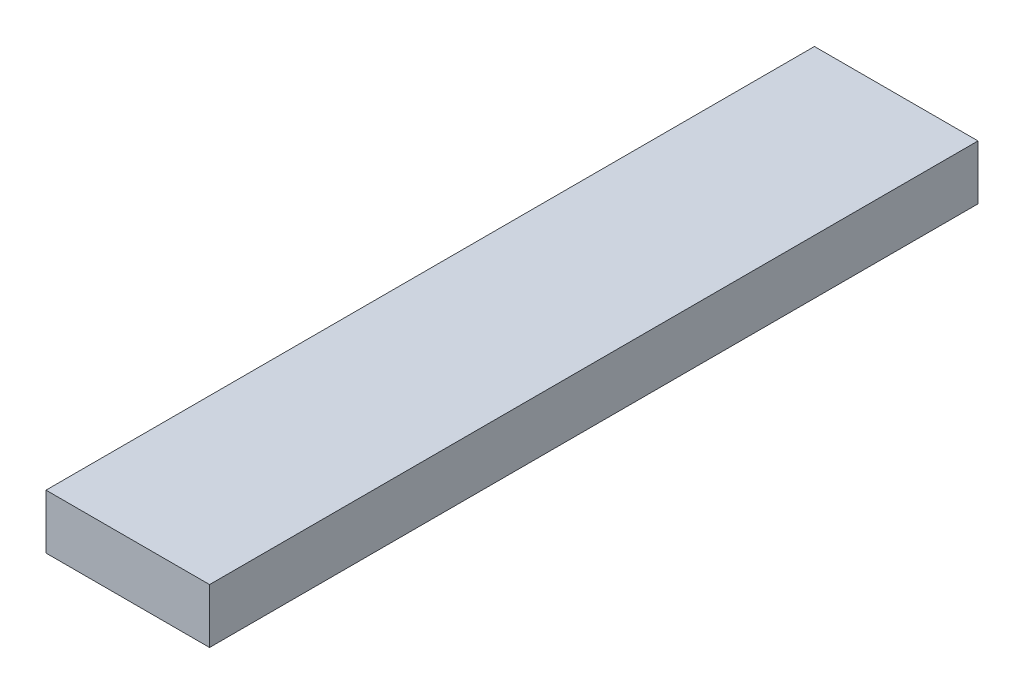
ISO-10303-21;
HEADER;
FILE_DESCRIPTION(('STEP AP214'),'2;1');
FILE_NAME('part.step','',(''),(''),'','','');
FILE_SCHEMA(('AUTOMOTIVE_DESIGN { 1 0 10303 214 1 1 1 1 }'));
ENDSEC;
DATA;
#1=APPLICATION_CONTEXT('core data for automotive mechanical design processes');
#2=APPLICATION_PROTOCOL_DEFINITION('international standard','automotive_design',2000,#1);
#3=PRODUCT_CONTEXT('',#1,'mechanical');
#4=PRODUCT('Part','Part','',(#3));
#5=PRODUCT_RELATED_PRODUCT_CATEGORY('part','',(#4));
#6=PRODUCT_DEFINITION_FORMATION('','',#4);
#7=PRODUCT_DEFINITION_CONTEXT('part definition',#1,'design');
#8=PRODUCT_DEFINITION('design','',#6,#7);
#9=PRODUCT_DEFINITION_SHAPE('','',#8);
#10=(LENGTH_UNIT() NAMED_UNIT(*) SI_UNIT(.MILLI.,.METRE.));
#11=(NAMED_UNIT(*) PLANE_ANGLE_UNIT() SI_UNIT($,.RADIAN.));
#12=(NAMED_UNIT(*) SI_UNIT($,.STERADIAN.) SOLID_ANGLE_UNIT());
#13=UNCERTAINTY_MEASURE_WITH_UNIT(LENGTH_MEASURE(1.E-05),#10,'distance_accuracy_value','');
#14=(GEOMETRIC_REPRESENTATION_CONTEXT(3) GLOBAL_UNCERTAINTY_ASSIGNED_CONTEXT((#13)) GLOBAL_UNIT_ASSIGNED_CONTEXT((#10,
#11,#12)) REPRESENTATION_CONTEXT('',''));
#15=CARTESIAN_POINT('',(0.,0.,0.));
#16=DIRECTION('',(0.,0.,1.));
#17=DIRECTION('',(1.,0.,0.));
#18=AXIS2_PLACEMENT_3D('',#15,#16,#17);
#19=CARTESIAN_POINT('',(0.,0.,179.));
#20=DIRECTION('',(1.,0.,0.));
#21=DIRECTION('',(0.,0.,-1.));
#22=AXIS2_PLACEMENT_3D('',#19,#20,#21);
#23=PLANE('',#22);
#24=DIRECTION('',(0.,-1.,0.));
#25=VECTOR('',#24,1.);
#26=CARTESIAN_POINT('',(0.,0.,0.));
#27=LINE('',#26,#25);
#28=CARTESIAN_POINT('',(0.,12.7,0.));
#29=VERTEX_POINT('',#28);
#30=CARTESIAN_POINT('',(0.,0.,0.));
#31=VERTEX_POINT('',#30);
#32=EDGE_CURVE('E107',#29,#31,#27,.T.);
#33=ORIENTED_EDGE('',*,*,#32,.T.);
#34=DIRECTION('',(0.,0.,-1.));
#35=VECTOR('',#34,1.);
#36=CARTESIAN_POINT('',(0.,0.,179.));
#37=LINE('',#36,#35);
#38=CARTESIAN_POINT('',(0.,0.,179.));
#39=VERTEX_POINT('',#38);
#40=EDGE_CURVE('E11',#39,#31,#37,.T.);
#41=ORIENTED_EDGE('',*,*,#40,.F.);
#42=DIRECTION('',(0.,-1.,0.));
#43=VECTOR('',#42,1.);
#44=CARTESIAN_POINT('',(0.,0.,179.));
#45=LINE('',#44,#43);
#46=CARTESIAN_POINT('',(0.,12.7,179.));
#47=VERTEX_POINT('',#46);
#48=EDGE_CURVE('E91',#47,#39,#45,.T.);
#49=ORIENTED_EDGE('',*,*,#48,.F.);
#50=DIRECTION('',(0.,0.,-1.));
#51=VECTOR('',#50,1.);
#52=CARTESIAN_POINT('',(0.,12.7,179.));
#53=LINE('',#52,#51);
#54=EDGE_CURVE('E103',#47,#29,#53,.T.);
#55=ORIENTED_EDGE('',*,*,#54,.T.);
#56=EDGE_LOOP('',(#33,#41,#49,#55));
#57=FACE_BOUND('',#56,.T.);
#58=ADVANCED_FACE('F39',(#57),#23,.F.);
#59=CARTESIAN_POINT('',(0.,0.,179.));
#60=DIRECTION('',(0.,1.,0.));
#61=DIRECTION('',(0.,0.,1.));
#62=AXIS2_PLACEMENT_3D('',#59,#60,#61);
#63=PLANE('',#62);
#64=DIRECTION('',(1.,0.,0.));
#65=VECTOR('',#64,1.);
#66=CARTESIAN_POINT('',(0.,0.,0.));
#67=LINE('',#66,#65);
#68=CARTESIAN_POINT('',(38.1,0.,0.));
#69=VERTEX_POINT('',#68);
#70=EDGE_CURVE('E96',#31,#69,#67,.T.);
#71=ORIENTED_EDGE('',*,*,#70,.T.);
#72=DIRECTION('',(0.,0.,-1.));
#73=VECTOR('',#72,1.);
#74=CARTESIAN_POINT('',(38.1,0.,179.));
#75=LINE('',#74,#73);
#76=CARTESIAN_POINT('',(38.1,0.,179.));
#77=VERTEX_POINT('',#76);
#78=EDGE_CURVE('E48',#77,#69,#75,.T.);
#79=ORIENTED_EDGE('',*,*,#78,.F.);
#80=DIRECTION('',(1.,0.,0.));
#81=VECTOR('',#80,1.);
#82=CARTESIAN_POINT('',(0.,0.,179.));
#83=LINE('',#82,#81);
#84=EDGE_CURVE('E86',#39,#77,#83,.T.);
#85=ORIENTED_EDGE('',*,*,#84,.F.);
#86=ORIENTED_EDGE('',*,*,#40,.T.);
#87=EDGE_LOOP('',(#71,#79,#85,#86));
#88=FACE_BOUND('',#87,.T.);
#89=ADVANCED_FACE('F95',(#88),#63,.F.);
#90=CARTESIAN_POINT('',(38.1,0.,179.));
#91=DIRECTION('',(-1.,0.,0.));
#92=DIRECTION('',(0.,0.,1.));
#93=AXIS2_PLACEMENT_3D('',#90,#91,#92);
#94=PLANE('',#93);
#95=DIRECTION('',(0.,1.,0.));
#96=VECTOR('',#95,1.);
#97=CARTESIAN_POINT('',(38.1,0.,0.));
#98=LINE('',#97,#96);
#99=CARTESIAN_POINT('',(38.1,12.7,0.));
#100=VERTEX_POINT('',#99);
#101=EDGE_CURVE('E73',#69,#100,#98,.T.);
#102=ORIENTED_EDGE('',*,*,#101,.T.);
#103=DIRECTION('',(0.,0.,-1.));
#104=VECTOR('',#103,1.);
#105=CARTESIAN_POINT('',(38.1,12.7,179.));
#106=LINE('',#105,#104);
#107=CARTESIAN_POINT('',(38.1,12.7,179.));
#108=VERTEX_POINT('',#107);
#109=EDGE_CURVE('E98',#108,#100,#106,.T.);
#110=ORIENTED_EDGE('',*,*,#109,.F.);
#111=DIRECTION('',(0.,1.,0.));
#112=VECTOR('',#111,1.);
#113=CARTESIAN_POINT('',(38.1,0.,179.));
#114=LINE('',#113,#112);
#115=EDGE_CURVE('E89',#77,#108,#114,.T.);
#116=ORIENTED_EDGE('',*,*,#115,.F.);
#117=ORIENTED_EDGE('',*,*,#78,.T.);
#118=EDGE_LOOP('',(#102,#110,#116,#117));
#119=FACE_BOUND('',#118,.T.);
#120=ADVANCED_FACE('F99',(#119),#94,.F.);
#121=CARTESIAN_POINT('',(0.,12.7,179.));
#122=DIRECTION('',(0.,-1.,0.));
#123=DIRECTION('',(0.,0.,-1.));
#124=AXIS2_PLACEMENT_3D('',#121,#122,#123);
#125=PLANE('',#124);
#126=DIRECTION('',(-1.,0.,0.));
#127=VECTOR('',#126,1.);
#128=CARTESIAN_POINT('',(0.,12.7,0.));
#129=LINE('',#128,#127);
#130=EDGE_CURVE('E79',#100,#29,#129,.T.);
#131=ORIENTED_EDGE('',*,*,#130,.T.);
#132=ORIENTED_EDGE('',*,*,#54,.F.);
#133=DIRECTION('',(-1.,0.,0.));
#134=VECTOR('',#133,1.);
#135=CARTESIAN_POINT('',(0.,12.7,179.));
#136=LINE('',#135,#134);
#137=EDGE_CURVE('E56',#108,#47,#136,.T.);
#138=ORIENTED_EDGE('',*,*,#137,.F.);
#139=ORIENTED_EDGE('',*,*,#109,.T.);
#140=EDGE_LOOP('',(#131,#132,#138,#139));
#141=FACE_BOUND('',#140,.T.);
#142=ADVANCED_FACE('F120',(#141),#125,.F.);
#143=CARTESIAN_POINT('',(0.,0.,179.));
#144=DIRECTION('',(0.,0.,-1.));
#145=DIRECTION('',(-1.,0.,0.));
#146=AXIS2_PLACEMENT_3D('',#143,#144,#145);
#147=PLANE('',#146);
#148=ORIENTED_EDGE('',*,*,#48,.T.);
#149=ORIENTED_EDGE('',*,*,#84,.T.);
#150=ORIENTED_EDGE('',*,*,#115,.T.);
#151=ORIENTED_EDGE('',*,*,#137,.T.);
#152=EDGE_LOOP('',(#148,#149,#150,#151));
#153=FACE_BOUND('',#152,.T.);
#154=ADVANCED_FACE('F87',(#153),#147,.F.);
#155=CARTESIAN_POINT('',(0.,0.,0.));
#156=DIRECTION('',(0.,0.,-1.));
#157=DIRECTION('',(-1.,0.,0.));
#158=AXIS2_PLACEMENT_3D('',#155,#156,#157);
#159=PLANE('',#158);
#160=ORIENTED_EDGE('',*,*,#32,.F.);
#161=ORIENTED_EDGE('',*,*,#130,.F.);
#162=ORIENTED_EDGE('',*,*,#101,.F.);
#163=ORIENTED_EDGE('',*,*,#70,.F.);
#164=EDGE_LOOP('',(#160,#161,#162,#163));
#165=FACE_BOUND('',#164,.T.);
#166=ADVANCED_FACE('F123',(#165),#159,.T.);
#167=CLOSED_SHELL('',(#58,#89,#120,#142,#154,#166));
#168=MANIFOLD_SOLID_BREP('B2',#167);
#169=ADVANCED_BREP_SHAPE_REPRESENTATION('',(#18,#168),#14);
#170=SHAPE_DEFINITION_REPRESENTATION(#9,#169);
ENDSEC;
END-ISO-10303-21;
